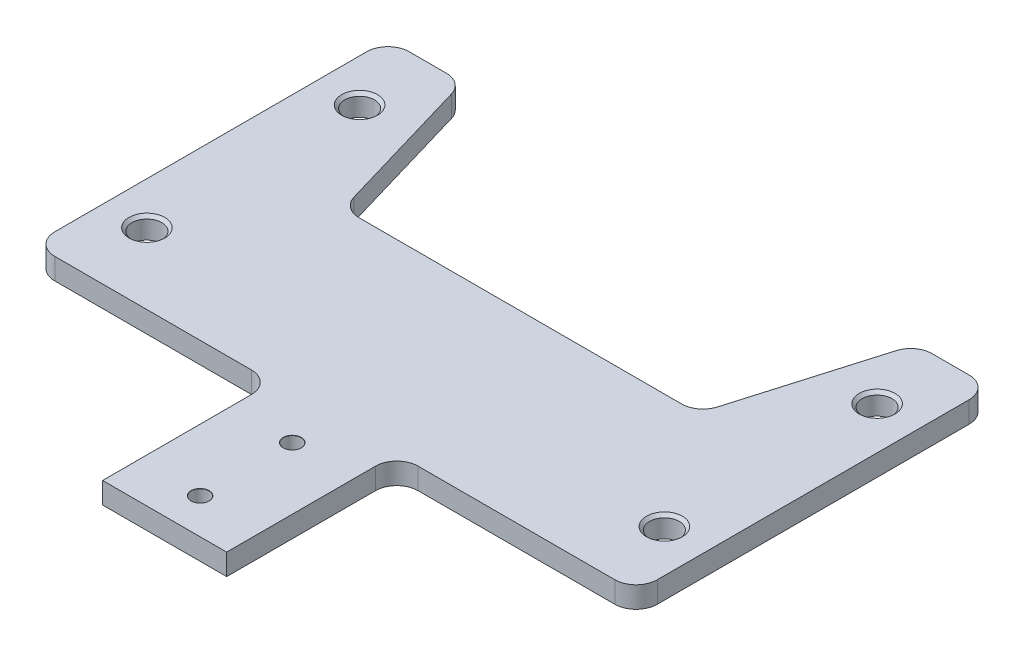
ISO-10303-21;
HEADER;
FILE_DESCRIPTION(('STEP AP214'),'2;1');
FILE_NAME('part.step','',(''),(''),'','','');
FILE_SCHEMA(('AUTOMOTIVE_DESIGN { 1 0 10303 214 1 1 1 1 }'));
ENDSEC;
DATA;
#1=APPLICATION_CONTEXT('core data for automotive mechanical design processes');
#2=APPLICATION_PROTOCOL_DEFINITION('international standard','automotive_design',2000,#1);
#3=PRODUCT_CONTEXT('',#1,'mechanical');
#4=PRODUCT('Part','Part','',(#3));
#5=PRODUCT_RELATED_PRODUCT_CATEGORY('part','',(#4));
#6=PRODUCT_DEFINITION_FORMATION('','',#4);
#7=PRODUCT_DEFINITION_CONTEXT('part definition',#1,'design');
#8=PRODUCT_DEFINITION('design','',#6,#7);
#9=PRODUCT_DEFINITION_SHAPE('','',#8);
#10=(LENGTH_UNIT() NAMED_UNIT(*) SI_UNIT(.MILLI.,.METRE.));
#11=(NAMED_UNIT(*) PLANE_ANGLE_UNIT() SI_UNIT($,.RADIAN.));
#12=(NAMED_UNIT(*) SI_UNIT($,.STERADIAN.) SOLID_ANGLE_UNIT());
#13=UNCERTAINTY_MEASURE_WITH_UNIT(LENGTH_MEASURE(1.E-05),#10,'distance_accuracy_value','');
#14=(GEOMETRIC_REPRESENTATION_CONTEXT(3) GLOBAL_UNCERTAINTY_ASSIGNED_CONTEXT((#13)) GLOBAL_UNIT_ASSIGNED_CONTEXT((#10,
#11,#12)) REPRESENTATION_CONTEXT('',''));
#15=CARTESIAN_POINT('',(0.,0.,0.));
#16=DIRECTION('',(0.,0.,1.));
#17=DIRECTION('',(1.,0.,0.));
#18=AXIS2_PLACEMENT_3D('',#15,#16,#17);
#19=CARTESIAN_POINT('',(-42.5,3.,0.));
#20=DIRECTION('',(0.,0.,-1.));
#21=DIRECTION('',(-1.,0.,0.));
#22=AXIS2_PLACEMENT_3D('',#19,#20,#21);
#23=PLANE('',#22);
#24=DIRECTION('',(1.,0.,0.));
#25=VECTOR('',#24,1.);
#26=CARTESIAN_POINT('',(-42.5,3.,0.));
#27=LINE('',#26,#25);
#28=CARTESIAN_POINT('',(11.75,3.,0.));
#29=VERTEX_POINT('',#28);
#30=CARTESIAN_POINT('',(39.5,3.,0.));
#31=VERTEX_POINT('',#30);
#32=EDGE_CURVE('E226',#29,#31,#27,.T.);
#33=ORIENTED_EDGE('',*,*,#32,.F.);
#34=DIRECTION('',(0.,1.,0.));
#35=VECTOR('',#34,1.);
#36=CARTESIAN_POINT('',(11.75,3.,0.));
#37=LINE('',#36,#35);
#38=CARTESIAN_POINT('',(11.75,0.,0.));
#39=VERTEX_POINT('',#38);
#40=EDGE_CURVE('E290',#29,#39,#37,.F.);
#41=ORIENTED_EDGE('',*,*,#40,.T.);
#42=DIRECTION('',(1.,0.,0.));
#43=VECTOR('',#42,1.);
#44=CARTESIAN_POINT('',(-42.5,0.,0.));
#45=LINE('',#44,#43);
#46=CARTESIAN_POINT('',(39.5,0.,0.));
#47=VERTEX_POINT('',#46);
#48=EDGE_CURVE('E221',#39,#47,#45,.T.);
#49=ORIENTED_EDGE('',*,*,#48,.T.);
#50=DIRECTION('',(0.,-1.,0.));
#51=VECTOR('',#50,1.);
#52=CARTESIAN_POINT('',(39.5,3.,0.));
#53=LINE('',#52,#51);
#54=EDGE_CURVE('E288',#47,#31,#53,.F.);
#55=ORIENTED_EDGE('',*,*,#54,.T.);
#56=EDGE_LOOP('',(#33,#41,#49,#55));
#57=FACE_BOUND('',#56,.T.);
#58=ADVANCED_FACE('F37',(#57),#23,.F.);
#59=CARTESIAN_POINT('',(-39.5,0.,0.));
#60=VERTEX_POINT('',#59);
#61=CARTESIAN_POINT('',(-11.75,0.,0.));
#62=VERTEX_POINT('',#61);
#63=EDGE_CURVE('E241',#60,#62,#45,.T.);
#64=ORIENTED_EDGE('',*,*,#63,.T.);
#65=DIRECTION('',(0.,1.,0.));
#66=VECTOR('',#65,1.);
#67=CARTESIAN_POINT('',(-11.75,3.,0.));
#68=LINE('',#67,#66);
#69=CARTESIAN_POINT('',(-11.75,3.,0.));
#70=VERTEX_POINT('',#69);
#71=EDGE_CURVE('E295',#62,#70,#68,.T.);
#72=ORIENTED_EDGE('',*,*,#71,.T.);
#73=CARTESIAN_POINT('',(-39.5,3.,0.));
#74=VERTEX_POINT('',#73);
#75=EDGE_CURVE('E223',#74,#70,#27,.T.);
#76=ORIENTED_EDGE('',*,*,#75,.F.);
#77=DIRECTION('',(0.,-1.,0.));
#78=VECTOR('',#77,1.);
#79=CARTESIAN_POINT('',(-39.5,3.,0.));
#80=LINE('',#79,#78);
#81=EDGE_CURVE('E292',#74,#60,#80,.T.);
#82=ORIENTED_EDGE('',*,*,#81,.T.);
#83=EDGE_LOOP('',(#64,#72,#76,#82));
#84=FACE_BOUND('',#83,.T.);
#85=ADVANCED_FACE('F447',(#84),#23,.F.);
#86=CARTESIAN_POINT('',(42.5,3.,0.));
#87=DIRECTION('',(-1.,0.,0.));
#88=DIRECTION('',(0.,0.,1.));
#89=AXIS2_PLACEMENT_3D('',#86,#87,#88);
#90=PLANE('',#89);
#91=DIRECTION('',(0.,0.,-1.));
#92=VECTOR('',#91,1.);
#93=CARTESIAN_POINT('',(42.5,3.,0.));
#94=LINE('',#93,#92);
#95=CARTESIAN_POINT('',(42.5,3.,-3.00000000000002));
#96=VERTEX_POINT('',#95);
#97=CARTESIAN_POINT('',(42.5,3.,-47.));
#98=VERTEX_POINT('',#97);
#99=EDGE_CURVE('E225',#96,#98,#94,.T.);
#100=ORIENTED_EDGE('',*,*,#99,.F.);
#101=DIRECTION('',(0.,-1.,0.));
#102=VECTOR('',#101,1.);
#103=CARTESIAN_POINT('',(42.5,3.,-3.00000000000002));
#104=LINE('',#103,#102);
#105=CARTESIAN_POINT('',(42.5,0.,-3.00000000000002));
#106=VERTEX_POINT('',#105);
#107=EDGE_CURVE('E302',#96,#106,#104,.T.);
#108=ORIENTED_EDGE('',*,*,#107,.T.);
#109=DIRECTION('',(0.,0.,-1.));
#110=VECTOR('',#109,1.);
#111=CARTESIAN_POINT('',(42.5,0.,0.));
#112=LINE('',#111,#110);
#113=CARTESIAN_POINT('',(42.5,0.,-47.));
#114=VERTEX_POINT('',#113);
#115=EDGE_CURVE('E244',#106,#114,#112,.T.);
#116=ORIENTED_EDGE('',*,*,#115,.T.);
#117=DIRECTION('',(0.,-1.,0.));
#118=VECTOR('',#117,1.);
#119=CARTESIAN_POINT('',(42.5,3.,-47.));
#120=LINE('',#119,#118);
#121=EDGE_CURVE('E300',#114,#98,#120,.F.);
#122=ORIENTED_EDGE('',*,*,#121,.T.);
#123=EDGE_LOOP('',(#100,#108,#116,#122));
#124=FACE_BOUND('',#123,.T.);
#125=ADVANCED_FACE('F451',(#124),#90,.F.);
#126=CARTESIAN_POINT('',(42.5,3.,-50.));
#127=DIRECTION('',(0.,0.,1.));
#128=DIRECTION('',(1.,0.,0.));
#129=AXIS2_PLACEMENT_3D('',#126,#127,#128);
#130=PLANE('',#129);
#131=DIRECTION('',(-1.,0.,0.));
#132=VECTOR('',#131,1.);
#133=CARTESIAN_POINT('',(42.5,3.,-50.));
#134=LINE('',#133,#132);
#135=CARTESIAN_POINT('',(39.5,3.,-50.));
#136=VERTEX_POINT('',#135);
#137=CARTESIAN_POINT('',(34.2451314063093,3.,-50.));
#138=VERTEX_POINT('',#137);
#139=EDGE_CURVE('E229',#136,#138,#134,.T.);
#140=ORIENTED_EDGE('',*,*,#139,.F.);
#141=DIRECTION('',(0.,-1.,0.));
#142=VECTOR('',#141,1.);
#143=CARTESIAN_POINT('',(39.5,3.,-50.));
#144=LINE('',#143,#142);
#145=CARTESIAN_POINT('',(39.5,0.,-50.));
#146=VERTEX_POINT('',#145);
#147=EDGE_CURVE('E336',#136,#146,#144,.T.);
#148=ORIENTED_EDGE('',*,*,#147,.T.);
#149=DIRECTION('',(-1.,0.,0.));
#150=VECTOR('',#149,1.);
#151=CARTESIAN_POINT('',(42.5,0.,-50.));
#152=LINE('',#151,#150);
#153=CARTESIAN_POINT('',(34.2451314063093,0.,-50.));
#154=VERTEX_POINT('',#153);
#155=EDGE_CURVE('E247',#146,#154,#152,.T.);
#156=ORIENTED_EDGE('',*,*,#155,.T.);
#157=DIRECTION('',(0.,-1.,0.));
#158=VECTOR('',#157,1.);
#159=CARTESIAN_POINT('',(34.2451314063093,3.,-50.));
#160=LINE('',#159,#158);
#161=EDGE_CURVE('E334',#154,#138,#160,.F.);
#162=ORIENTED_EDGE('',*,*,#161,.T.);
#163=EDGE_LOOP('',(#140,#148,#156,#162));
#164=FACE_BOUND('',#163,.T.);
#165=ADVANCED_FACE('F456',(#164),#130,.F.);
#166=CARTESIAN_POINT('',(8.75,3.,-26.1843013959278));
#167=DIRECTION('',(0.,0.,1.));
#168=DIRECTION('',(1.,0.,0.));
#169=AXIS2_PLACEMENT_3D('',#166,#167,#168);
#170=PLANE('',#169);
#171=DIRECTION('',(-1.,0.,0.));
#172=VECTOR('',#171,1.);
#173=CARTESIAN_POINT('',(8.75,3.,-26.1843013959278));
#174=LINE('',#173,#172);
#175=CARTESIAN_POINT('',(22.7548685936907,3.,-26.1843013959278));
#176=VERTEX_POINT('',#175);
#177=CARTESIAN_POINT('',(-22.7548685936907,3.,-26.1843013959278));
#178=VERTEX_POINT('',#177);
#179=EDGE_CURVE('E232',#176,#178,#174,.T.);
#180=ORIENTED_EDGE('',*,*,#179,.F.);
#181=DIRECTION('',(0.,-1.,0.));
#182=VECTOR('',#181,1.);
#183=CARTESIAN_POINT('',(22.7548685936907,0.,-26.1843013959278));
#184=LINE('',#183,#182);
#185=CARTESIAN_POINT('',(22.7548685936907,0.,-26.1843013959278));
#186=VERTEX_POINT('',#185);
#187=EDGE_CURVE('E355',#176,#186,#184,.T.);
#188=ORIENTED_EDGE('',*,*,#187,.T.);
#189=DIRECTION('',(-1.,0.,0.));
#190=VECTOR('',#189,1.);
#191=CARTESIAN_POINT('',(8.75,0.,-26.1843013959278));
#192=LINE('',#191,#190);
#193=CARTESIAN_POINT('',(-22.7548685936907,0.,-26.1843013959278));
#194=VERTEX_POINT('',#193);
#195=EDGE_CURVE('E250',#186,#194,#192,.T.);
#196=ORIENTED_EDGE('',*,*,#195,.T.);
#197=DIRECTION('',(0.,-1.,0.));
#198=VECTOR('',#197,1.);
#199=CARTESIAN_POINT('',(-22.7548685936907,3.,-26.1843013959278));
#200=LINE('',#199,#198);
#201=EDGE_CURVE('E52',#194,#178,#200,.F.);
#202=ORIENTED_EDGE('',*,*,#201,.T.);
#203=EDGE_LOOP('',(#180,#188,#196,#202));
#204=FACE_BOUND('',#203,.T.);
#205=ADVANCED_FACE('F376',(#204),#170,.F.);
#206=CARTESIAN_POINT('',(-22.5,3.,-50.));
#207=DIRECTION('',(0.,0.,1.));
#208=DIRECTION('',(1.,0.,0.));
#209=AXIS2_PLACEMENT_3D('',#206,#207,#208);
#210=PLANE('',#209);
#211=DIRECTION('',(-1.,0.,0.));
#212=VECTOR('',#211,1.);
#213=CARTESIAN_POINT('',(-22.5,0.,-50.));
#214=LINE('',#213,#212);
#215=CARTESIAN_POINT('',(-34.2451314063093,0.,-50.));
#216=VERTEX_POINT('',#215);
#217=CARTESIAN_POINT('',(-39.5,0.,-50.));
#218=VERTEX_POINT('',#217);
#219=EDGE_CURVE('E252',#216,#218,#214,.T.);
#220=ORIENTED_EDGE('',*,*,#219,.T.);
#221=DIRECTION('',(0.,-1.,0.));
#222=VECTOR('',#221,1.);
#223=CARTESIAN_POINT('',(-39.5,3.,-50.));
#224=LINE('',#223,#222);
#225=CARTESIAN_POINT('',(-39.5,3.,-50.));
#226=VERTEX_POINT('',#225);
#227=EDGE_CURVE('E342',#218,#226,#224,.F.);
#228=ORIENTED_EDGE('',*,*,#227,.T.);
#229=DIRECTION('',(-1.,0.,0.));
#230=VECTOR('',#229,1.);
#231=CARTESIAN_POINT('',(-22.5,3.,-50.));
#232=LINE('',#231,#230);
#233=CARTESIAN_POINT('',(-34.2451314063093,3.,-50.));
#234=VERTEX_POINT('',#233);
#235=EDGE_CURVE('E234',#234,#226,#232,.T.);
#236=ORIENTED_EDGE('',*,*,#235,.F.);
#237=DIRECTION('',(0.,-1.,0.));
#238=VECTOR('',#237,1.);
#239=CARTESIAN_POINT('',(-34.2451314063093,3.,-50.));
#240=LINE('',#239,#238);
#241=EDGE_CURVE('E339',#234,#216,#240,.T.);
#242=ORIENTED_EDGE('',*,*,#241,.T.);
#243=EDGE_LOOP('',(#220,#228,#236,#242));
#244=FACE_BOUND('',#243,.T.);
#245=ADVANCED_FACE('F463',(#244),#210,.F.);
#246=CARTESIAN_POINT('',(-42.5,3.,-50.));
#247=DIRECTION('',(1.,0.,0.));
#248=DIRECTION('',(0.,0.,-1.));
#249=AXIS2_PLACEMENT_3D('',#246,#247,#248);
#250=PLANE('',#249);
#251=DIRECTION('',(0.,0.,1.));
#252=VECTOR('',#251,1.);
#253=CARTESIAN_POINT('',(-42.5,0.,-50.));
#254=LINE('',#253,#252);
#255=CARTESIAN_POINT('',(-42.5,0.,-47.));
#256=VERTEX_POINT('',#255);
#257=CARTESIAN_POINT('',(-42.5,0.,-3.));
#258=VERTEX_POINT('',#257);
#259=EDGE_CURVE('E255',#256,#258,#254,.T.);
#260=ORIENTED_EDGE('',*,*,#259,.T.);
#261=DIRECTION('',(0.,-1.,0.));
#262=VECTOR('',#261,1.);
#263=CARTESIAN_POINT('',(-42.5,3.,-3.));
#264=LINE('',#263,#262);
#265=CARTESIAN_POINT('',(-42.5,3.,-3.));
#266=VERTEX_POINT('',#265);
#267=EDGE_CURVE('E332',#258,#266,#264,.F.);
#268=ORIENTED_EDGE('',*,*,#267,.T.);
#269=DIRECTION('',(0.,0.,1.));
#270=VECTOR('',#269,1.);
#271=CARTESIAN_POINT('',(-42.5,3.,-50.));
#272=LINE('',#271,#270);
#273=CARTESIAN_POINT('',(-42.5,3.,-47.));
#274=VERTEX_POINT('',#273);
#275=EDGE_CURVE('E237',#274,#266,#272,.T.);
#276=ORIENTED_EDGE('',*,*,#275,.F.);
#277=DIRECTION('',(0.,-1.,0.));
#278=VECTOR('',#277,1.);
#279=CARTESIAN_POINT('',(-42.5,3.,-47.));
#280=LINE('',#279,#278);
#281=EDGE_CURVE('E329',#274,#256,#280,.T.);
#282=ORIENTED_EDGE('',*,*,#281,.T.);
#283=EDGE_LOOP('',(#260,#268,#276,#282));
#284=FACE_BOUND('',#283,.T.);
#285=ADVANCED_FACE('F466',(#284),#250,.F.);
#286=CARTESIAN_POINT('',(0.,3.,0.));
#287=DIRECTION('',(0.,1.,0.));
#288=DIRECTION('',(0.,0.,1.));
#289=AXIS2_PLACEMENT_3D('',#286,#287,#288);
#290=PLANE('',#289);
#291=ORIENTED_EDGE('',*,*,#32,.T.);
#292=CARTESIAN_POINT('',(39.5,3.,-3.00000000000002));
#293=DIRECTION('',(0.,1.,0.));
#294=DIRECTION('',(0.,0.,1.));
#295=AXIS2_PLACEMENT_3D('',#292,#293,#294);
#296=CIRCLE('',#295,3.);
#297=EDGE_CURVE('E327',#31,#96,#296,.T.);
#298=ORIENTED_EDGE('',*,*,#297,.T.);
#299=ORIENTED_EDGE('',*,*,#99,.T.);
#300=CARTESIAN_POINT('',(39.5,3.,-47.));
#301=DIRECTION('',(0.,1.,0.));
#302=DIRECTION('',(0.,0.,1.));
#303=AXIS2_PLACEMENT_3D('',#300,#301,#302);
#304=CIRCLE('',#303,3.);
#305=EDGE_CURVE('E323',#98,#136,#304,.T.);
#306=ORIENTED_EDGE('',*,*,#305,.T.);
#307=ORIENTED_EDGE('',*,*,#139,.T.);
#308=CARTESIAN_POINT('',(34.2451314063093,3.,-47.));
#309=DIRECTION('',(0.,1.,0.));
#310=DIRECTION('',(0.,0.,1.));
#311=AXIS2_PLACEMENT_3D('',#308,#309,#310);
#312=CIRCLE('',#311,3.);
#313=CARTESIAN_POINT('',(31.3668838920355,3.,-47.8459853701907));
#314=VERTEX_POINT('',#313);
#315=EDGE_CURVE('E317',#138,#314,#312,.T.);
#316=ORIENTED_EDGE('',*,*,#315,.T.);
#317=DIRECTION('',(-0.281995123396906,0.,0.959415838091265));
#318=VECTOR('',#317,1.);
#319=CARTESIAN_POINT('',(25.,3.,-26.1843013959278));
#320=LINE('',#319,#318);
#321=CARTESIAN_POINT('',(25.6331161079645,3.,-28.3383160257371));
#322=VERTEX_POINT('',#321);
#323=EDGE_CURVE('E387',#314,#322,#320,.T.);
#324=ORIENTED_EDGE('',*,*,#323,.T.);
#325=CARTESIAN_POINT('',(22.7548685936907,3.,-29.1843013959278));
#326=DIRECTION('',(0.,1.,0.));
#327=DIRECTION('',(0.,0.,1.));
#328=AXIS2_PLACEMENT_3D('',#325,#326,#327);
#329=CIRCLE('',#328,3.);
#330=EDGE_CURVE('E59',#322,#176,#329,.F.);
#331=ORIENTED_EDGE('',*,*,#330,.T.);
#332=ORIENTED_EDGE('',*,*,#179,.T.);
#333=CARTESIAN_POINT('',(-22.7548685936907,3.,-29.1843013959278));
#334=DIRECTION('',(0.,1.,0.));
#335=DIRECTION('',(0.,0.,1.));
#336=AXIS2_PLACEMENT_3D('',#333,#334,#335);
#337=CIRCLE('',#336,3.);
#338=CARTESIAN_POINT('',(-25.6331161079645,3.,-28.3383160257371));
#339=VERTEX_POINT('',#338);
#340=EDGE_CURVE('E11',#178,#339,#337,.F.);
#341=ORIENTED_EDGE('',*,*,#340,.T.);
#342=DIRECTION('',(-0.281995123396906,0.,-0.959415838091265));
#343=VECTOR('',#342,1.);
#344=CARTESIAN_POINT('',(-32.,3.,-50.));
#345=LINE('',#344,#343);
#346=CARTESIAN_POINT('',(-31.3668838920355,3.,-47.8459853701907));
#347=VERTEX_POINT('',#346);
#348=EDGE_CURVE('E381',#339,#347,#345,.T.);
#349=ORIENTED_EDGE('',*,*,#348,.T.);
#350=CARTESIAN_POINT('',(-34.2451314063093,3.,-47.));
#351=DIRECTION('',(0.,1.,0.));
#352=DIRECTION('',(0.,0.,1.));
#353=AXIS2_PLACEMENT_3D('',#350,#351,#352);
#354=CIRCLE('',#353,3.);
#355=EDGE_CURVE('E319',#347,#234,#354,.T.);
#356=ORIENTED_EDGE('',*,*,#355,.T.);
#357=ORIENTED_EDGE('',*,*,#235,.T.);
#358=CARTESIAN_POINT('',(-39.5,3.,-47.));
#359=DIRECTION('',(0.,1.,0.));
#360=DIRECTION('',(0.,0.,1.));
#361=AXIS2_PLACEMENT_3D('',#358,#359,#360);
#362=CIRCLE('',#361,3.);
#363=EDGE_CURVE('E321',#226,#274,#362,.T.);
#364=ORIENTED_EDGE('',*,*,#363,.T.);
#365=ORIENTED_EDGE('',*,*,#275,.T.);
#366=CARTESIAN_POINT('',(-39.5,3.,-3.));
#367=DIRECTION('',(0.,1.,0.));
#368=DIRECTION('',(0.,0.,1.));
#369=AXIS2_PLACEMENT_3D('',#366,#367,#368);
#370=CIRCLE('',#369,3.);
#371=EDGE_CURVE('E325',#266,#74,#370,.T.);
#372=ORIENTED_EDGE('',*,*,#371,.T.);
#373=ORIENTED_EDGE('',*,*,#75,.T.);
#374=CARTESIAN_POINT('',(-11.75,3.,2.99999999999999));
#375=DIRECTION('',(0.,1.,0.));
#376=DIRECTION('',(0.,0.,1.));
#377=AXIS2_PLACEMENT_3D('',#374,#375,#376);
#378=CIRCLE('',#377,3.);
#379=CARTESIAN_POINT('',(-8.75,3.,2.99999999999999));
#380=VERTEX_POINT('',#379);
#381=EDGE_CURVE('E196',#70,#380,#378,.F.);
#382=ORIENTED_EDGE('',*,*,#381,.T.);
#383=DIRECTION('',(0.,0.,1.));
#384=VECTOR('',#383,1.);
#385=CARTESIAN_POINT('',(-8.75,3.,0.));
#386=LINE('',#385,#384);
#387=CARTESIAN_POINT('',(-8.75,3.,24.));
#388=VERTEX_POINT('',#387);
#389=EDGE_CURVE('E186',#380,#388,#386,.T.);
#390=ORIENTED_EDGE('',*,*,#389,.T.);
#391=DIRECTION('',(1.,0.,0.));
#392=VECTOR('',#391,1.);
#393=CARTESIAN_POINT('',(-8.75,3.,24.));
#394=LINE('',#393,#392);
#395=CARTESIAN_POINT('',(8.75,3.,24.));
#396=VERTEX_POINT('',#395);
#397=EDGE_CURVE('E193',#388,#396,#394,.T.);
#398=ORIENTED_EDGE('',*,*,#397,.T.);
#399=DIRECTION('',(0.,0.,-1.));
#400=VECTOR('',#399,1.);
#401=CARTESIAN_POINT('',(8.75,3.,24.));
#402=LINE('',#401,#400);
#403=CARTESIAN_POINT('',(8.75,3.,2.99999999999999));
#404=VERTEX_POINT('',#403);
#405=EDGE_CURVE('E210',#396,#404,#402,.T.);
#406=ORIENTED_EDGE('',*,*,#405,.T.);
#407=CARTESIAN_POINT('',(11.75,3.,2.99999999999999));
#408=DIRECTION('',(0.,1.,0.));
#409=DIRECTION('',(0.,0.,1.));
#410=AXIS2_PLACEMENT_3D('',#407,#408,#409);
#411=CIRCLE('',#410,3.);
#412=EDGE_CURVE('E358',#404,#29,#411,.F.);
#413=ORIENTED_EDGE('',*,*,#412,.T.);
#414=EDGE_LOOP('',(#291,#298,#299,#306,#307,#316,#324,#331,#332,#341,#349,#356,#357,#364,#365,
#372,#373,#382,#390,#398,#406,#413));
#415=FACE_BOUND('',#414,.T.);
#416=CARTESIAN_POINT('',(-36.5,3.,-40.));
#417=DIRECTION('',(0.,1.,0.));
#418=DIRECTION('',(0.,0.,1.));
#419=AXIS2_PLACEMENT_3D('',#416,#417,#418);
#420=CIRCLE('',#419,2.525);
#421=CARTESIAN_POINT('',(-36.5,3.,-37.475));
#422=VERTEX_POINT('',#421);
#423=EDGE_CURVE('E386',#422,#422,#420,.T.);
#424=ORIENTED_EDGE('',*,*,#423,.F.);
#425=EDGE_LOOP('',(#424));
#426=FACE_BOUND('',#425,.T.);
#427=CARTESIAN_POINT('',(36.5,3.,-40.));
#428=DIRECTION('',(0.,1.,0.));
#429=DIRECTION('',(0.,0.,1.));
#430=AXIS2_PLACEMENT_3D('',#427,#428,#429);
#431=CIRCLE('',#430,2.525);
#432=CARTESIAN_POINT('',(36.5,3.,-37.475));
#433=VERTEX_POINT('',#432);
#434=EDGE_CURVE('E284',#433,#433,#431,.T.);
#435=ORIENTED_EDGE('',*,*,#434,.F.);
#436=EDGE_LOOP('',(#435));
#437=FACE_BOUND('',#436,.T.);
#438=CARTESIAN_POINT('',(-36.5,3.,-10.));
#439=DIRECTION('',(0.,1.,0.));
#440=DIRECTION('',(0.,0.,1.));
#441=AXIS2_PLACEMENT_3D('',#438,#439,#440);
#442=CIRCLE('',#441,2.525);
#443=CARTESIAN_POINT('',(-36.5,3.,-7.475));
#444=VERTEX_POINT('',#443);
#445=EDGE_CURVE('E279',#444,#444,#442,.T.);
#446=ORIENTED_EDGE('',*,*,#445,.F.);
#447=EDGE_LOOP('',(#446));
#448=FACE_BOUND('',#447,.T.);
#449=CARTESIAN_POINT('',(36.5,3.,-10.));
#450=DIRECTION('',(0.,1.,0.));
#451=DIRECTION('',(0.,0.,1.));
#452=AXIS2_PLACEMENT_3D('',#449,#450,#451);
#453=CIRCLE('',#452,2.525);
#454=CARTESIAN_POINT('',(36.5,3.,-7.475));
#455=VERTEX_POINT('',#454);
#456=EDGE_CURVE('E274',#455,#455,#453,.T.);
#457=ORIENTED_EDGE('',*,*,#456,.F.);
#458=EDGE_LOOP('',(#457));
#459=FACE_BOUND('',#458,.T.);
#460=CARTESIAN_POINT('',(0.,3.,19.));
#461=DIRECTION('',(0.,1.,0.));
#462=DIRECTION('',(0.,0.,1.));
#463=AXIS2_PLACEMENT_3D('',#460,#461,#462);
#464=CIRCLE('',#463,1.275);
#465=CARTESIAN_POINT('',(0.,3.,20.275));
#466=VERTEX_POINT('',#465);
#467=EDGE_CURVE('E269',#466,#466,#464,.T.);
#468=ORIENTED_EDGE('',*,*,#467,.F.);
#469=EDGE_LOOP('',(#468));
#470=FACE_BOUND('',#469,.T.);
#471=CARTESIAN_POINT('',(0.,3.,6.));
#472=DIRECTION('',(0.,1.,0.));
#473=DIRECTION('',(0.,0.,1.));
#474=AXIS2_PLACEMENT_3D('',#471,#472,#473);
#475=CIRCLE('',#474,1.275);
#476=CARTESIAN_POINT('',(0.,3.,7.275));
#477=VERTEX_POINT('',#476);
#478=EDGE_CURVE('E264',#477,#477,#475,.T.);
#479=ORIENTED_EDGE('',*,*,#478,.F.);
#480=EDGE_LOOP('',(#479));
#481=FACE_BOUND('',#480,.T.);
#482=ADVANCED_FACE('F189',(#415,#426,#437,#448,#459,#470,#481),#290,.T.);
#483=CARTESIAN_POINT('',(0.,0.,0.));
#484=DIRECTION('',(0.,1.,0.));
#485=DIRECTION('',(0.,0.,1.));
#486=AXIS2_PLACEMENT_3D('',#483,#484,#485);
#487=PLANE('',#486);
#488=CARTESIAN_POINT('',(-36.5,0.,-40.));
#489=DIRECTION('',(0.,1.,0.));
#490=DIRECTION('',(0.,0.,1.));
#491=AXIS2_PLACEMENT_3D('',#488,#489,#490);
#492=CIRCLE('',#491,2.1);
#493=CARTESIAN_POINT('',(-36.5,0.,-37.9));
#494=VERTEX_POINT('',#493);
#495=EDGE_CURVE('E281',#494,#494,#492,.T.);
#496=ORIENTED_EDGE('',*,*,#495,.T.);
#497=EDGE_LOOP('',(#496));
#498=FACE_BOUND('',#497,.T.);
#499=CARTESIAN_POINT('',(36.5,0.,-40.));
#500=DIRECTION('',(0.,1.,0.));
#501=DIRECTION('',(0.,0.,1.));
#502=AXIS2_PLACEMENT_3D('',#499,#500,#501);
#503=CIRCLE('',#502,2.1);
#504=CARTESIAN_POINT('',(36.5,0.,-37.9));
#505=VERTEX_POINT('',#504);
#506=EDGE_CURVE('E276',#505,#505,#503,.T.);
#507=ORIENTED_EDGE('',*,*,#506,.T.);
#508=EDGE_LOOP('',(#507));
#509=FACE_BOUND('',#508,.T.);
#510=CARTESIAN_POINT('',(-36.5,0.,-10.));
#511=DIRECTION('',(0.,1.,0.));
#512=DIRECTION('',(0.,0.,1.));
#513=AXIS2_PLACEMENT_3D('',#510,#511,#512);
#514=CIRCLE('',#513,2.1);
#515=CARTESIAN_POINT('',(-36.5,0.,-7.9));
#516=VERTEX_POINT('',#515);
#517=EDGE_CURVE('E271',#516,#516,#514,.T.);
#518=ORIENTED_EDGE('',*,*,#517,.T.);
#519=EDGE_LOOP('',(#518));
#520=FACE_BOUND('',#519,.T.);
#521=CARTESIAN_POINT('',(36.5,0.,-10.));
#522=DIRECTION('',(0.,1.,0.));
#523=DIRECTION('',(0.,0.,1.));
#524=AXIS2_PLACEMENT_3D('',#521,#522,#523);
#525=CIRCLE('',#524,2.1);
#526=CARTESIAN_POINT('',(36.5,0.,-7.9));
#527=VERTEX_POINT('',#526);
#528=EDGE_CURVE('E266',#527,#527,#525,.T.);
#529=ORIENTED_EDGE('',*,*,#528,.T.);
#530=EDGE_LOOP('',(#529));
#531=FACE_BOUND('',#530,.T.);
#532=CARTESIAN_POINT('',(0.,0.,19.));
#533=DIRECTION('',(0.,1.,0.));
#534=DIRECTION('',(0.,0.,1.));
#535=AXIS2_PLACEMENT_3D('',#532,#533,#534);
#536=CIRCLE('',#535,1.25);
#537=CARTESIAN_POINT('',(0.,0.,20.25));
#538=VERTEX_POINT('',#537);
#539=EDGE_CURVE('E261',#538,#538,#536,.T.);
#540=ORIENTED_EDGE('',*,*,#539,.T.);
#541=EDGE_LOOP('',(#540));
#542=FACE_BOUND('',#541,.T.);
#543=CARTESIAN_POINT('',(0.,0.,6.));
#544=DIRECTION('',(0.,1.,0.));
#545=DIRECTION('',(0.,0.,1.));
#546=AXIS2_PLACEMENT_3D('',#543,#544,#545);
#547=CIRCLE('',#546,1.25);
#548=CARTESIAN_POINT('',(0.,0.,7.25));
#549=VERTEX_POINT('',#548);
#550=EDGE_CURVE('E199',#549,#549,#547,.T.);
#551=ORIENTED_EDGE('',*,*,#550,.T.);
#552=EDGE_LOOP('',(#551));
#553=FACE_BOUND('',#552,.T.);
#554=ORIENTED_EDGE('',*,*,#115,.F.);
#555=CARTESIAN_POINT('',(39.5,0.,-3.00000000000002));
#556=DIRECTION('',(0.,1.,0.));
#557=DIRECTION('',(0.,0.,1.));
#558=AXIS2_PLACEMENT_3D('',#555,#556,#557);
#559=CIRCLE('',#558,3.);
#560=EDGE_CURVE('E315',#106,#47,#559,.F.);
#561=ORIENTED_EDGE('',*,*,#560,.T.);
#562=ORIENTED_EDGE('',*,*,#48,.F.);
#563=CARTESIAN_POINT('',(11.75,0.,2.99999999999999));
#564=DIRECTION('',(0.,1.,0.));
#565=DIRECTION('',(0.,0.,1.));
#566=AXIS2_PLACEMENT_3D('',#563,#564,#565);
#567=CIRCLE('',#566,3.);
#568=CARTESIAN_POINT('',(8.75,0.,2.99999999999999));
#569=VERTEX_POINT('',#568);
#570=EDGE_CURVE('E360',#39,#569,#567,.T.);
#571=ORIENTED_EDGE('',*,*,#570,.T.);
#572=DIRECTION('',(0.,0.,1.));
#573=VECTOR('',#572,1.);
#574=CARTESIAN_POINT('',(8.75,0.,24.));
#575=LINE('',#574,#573);
#576=CARTESIAN_POINT('',(8.75,0.,24.));
#577=VERTEX_POINT('',#576);
#578=EDGE_CURVE('E222',#569,#577,#575,.T.);
#579=ORIENTED_EDGE('',*,*,#578,.T.);
#580=DIRECTION('',(-1.,0.,0.));
#581=VECTOR('',#580,1.);
#582=CARTESIAN_POINT('',(-8.75,0.,24.));
#583=LINE('',#582,#581);
#584=CARTESIAN_POINT('',(-8.75,0.,24.));
#585=VERTEX_POINT('',#584);
#586=EDGE_CURVE('E218',#577,#585,#583,.T.);
#587=ORIENTED_EDGE('',*,*,#586,.T.);
#588=DIRECTION('',(0.,0.,-1.));
#589=VECTOR('',#588,1.);
#590=CARTESIAN_POINT('',(-8.75,0.,0.));
#591=LINE('',#590,#589);
#592=CARTESIAN_POINT('',(-8.75,0.,2.99999999999999));
#593=VERTEX_POINT('',#592);
#594=EDGE_CURVE('E206',#585,#593,#591,.T.);
#595=ORIENTED_EDGE('',*,*,#594,.T.);
#596=CARTESIAN_POINT('',(-11.75,0.,2.99999999999999));
#597=DIRECTION('',(0.,1.,0.));
#598=DIRECTION('',(0.,0.,1.));
#599=AXIS2_PLACEMENT_3D('',#596,#597,#598);
#600=CIRCLE('',#599,3.);
#601=EDGE_CURVE('E363',#593,#62,#600,.T.);
#602=ORIENTED_EDGE('',*,*,#601,.T.);
#603=ORIENTED_EDGE('',*,*,#63,.F.);
#604=CARTESIAN_POINT('',(-39.5,0.,-3.));
#605=DIRECTION('',(0.,1.,0.));
#606=DIRECTION('',(0.,0.,1.));
#607=AXIS2_PLACEMENT_3D('',#604,#605,#606);
#608=CIRCLE('',#607,3.);
#609=EDGE_CURVE('E313',#60,#258,#608,.F.);
#610=ORIENTED_EDGE('',*,*,#609,.T.);
#611=ORIENTED_EDGE('',*,*,#259,.F.);
#612=CARTESIAN_POINT('',(-39.5,0.,-47.));
#613=DIRECTION('',(0.,1.,0.));
#614=DIRECTION('',(0.,0.,1.));
#615=AXIS2_PLACEMENT_3D('',#612,#613,#614);
#616=CIRCLE('',#615,3.);
#617=EDGE_CURVE('E309',#256,#218,#616,.F.);
#618=ORIENTED_EDGE('',*,*,#617,.T.);
#619=ORIENTED_EDGE('',*,*,#219,.F.);
#620=CARTESIAN_POINT('',(-34.2451314063093,0.,-47.));
#621=DIRECTION('',(0.,1.,0.));
#622=DIRECTION('',(0.,0.,1.));
#623=AXIS2_PLACEMENT_3D('',#620,#621,#622);
#624=CIRCLE('',#623,3.);
#625=CARTESIAN_POINT('',(-31.3668838920355,0.,-47.8459853701907));
#626=VERTEX_POINT('',#625);
#627=EDGE_CURVE('E307',#216,#626,#624,.F.);
#628=ORIENTED_EDGE('',*,*,#627,.T.);
#629=DIRECTION('',(-0.281995123396906,0.,-0.959415838091265));
#630=VECTOR('',#629,1.);
#631=CARTESIAN_POINT('',(-32.,0.,-50.));
#632=LINE('',#631,#630);
#633=CARTESIAN_POINT('',(-25.6331161079645,0.,-28.3383160257371));
#634=VERTEX_POINT('',#633);
#635=EDGE_CURVE('E373',#634,#626,#632,.T.);
#636=ORIENTED_EDGE('',*,*,#635,.F.);
#637=CARTESIAN_POINT('',(-22.7548685936907,0.,-29.1843013959278));
#638=DIRECTION('',(0.,1.,0.));
#639=DIRECTION('',(0.,0.,1.));
#640=AXIS2_PLACEMENT_3D('',#637,#638,#639);
#641=CIRCLE('',#640,3.);
#642=EDGE_CURVE('E45',#634,#194,#641,.T.);
#643=ORIENTED_EDGE('',*,*,#642,.T.);
#644=ORIENTED_EDGE('',*,*,#195,.F.);
#645=CARTESIAN_POINT('',(22.7548685936907,0.,-29.1843013959278));
#646=DIRECTION('',(0.,1.,0.));
#647=DIRECTION('',(0.,0.,1.));
#648=AXIS2_PLACEMENT_3D('',#645,#646,#647);
#649=CIRCLE('',#648,3.);
#650=CARTESIAN_POINT('',(25.6331161079645,0.,-28.3383160257371));
#651=VERTEX_POINT('',#650);
#652=EDGE_CURVE('E365',#186,#651,#649,.T.);
#653=ORIENTED_EDGE('',*,*,#652,.T.);
#654=DIRECTION('',(-0.281995123396906,0.,0.959415838091265));
#655=VECTOR('',#654,1.);
#656=CARTESIAN_POINT('',(25.,0.,-26.1843013959278));
#657=LINE('',#656,#655);
#658=CARTESIAN_POINT('',(31.3668838920355,0.,-47.8459853701907));
#659=VERTEX_POINT('',#658);
#660=EDGE_CURVE('E393',#659,#651,#657,.T.);
#661=ORIENTED_EDGE('',*,*,#660,.F.);
#662=CARTESIAN_POINT('',(34.2451314063093,0.,-47.));
#663=DIRECTION('',(0.,1.,0.));
#664=DIRECTION('',(0.,0.,1.));
#665=AXIS2_PLACEMENT_3D('',#662,#663,#664);
#666=CIRCLE('',#665,3.);
#667=EDGE_CURVE('E305',#659,#154,#666,.F.);
#668=ORIENTED_EDGE('',*,*,#667,.T.);
#669=ORIENTED_EDGE('',*,*,#155,.F.);
#670=CARTESIAN_POINT('',(39.5,0.,-47.));
#671=DIRECTION('',(0.,1.,0.));
#672=DIRECTION('',(0.,0.,1.));
#673=AXIS2_PLACEMENT_3D('',#670,#671,#672);
#674=CIRCLE('',#673,3.);
#675=EDGE_CURVE('E311',#146,#114,#674,.F.);
#676=ORIENTED_EDGE('',*,*,#675,.T.);
#677=EDGE_LOOP('',(#554,#561,#562,#571,#579,#587,#595,#602,#603,#610,#611,#618,#619,#628,#636,
#643,#644,#653,#661,#668,#669,#676));
#678=FACE_BOUND('',#677,.T.);
#679=ADVANCED_FACE('F371',(#498,#509,#520,#531,#542,#553,#678),#487,.F.);
#680=CARTESIAN_POINT('',(8.75,-29.7026934805583,24.));
#681=DIRECTION('',(1.,0.,0.));
#682=DIRECTION('',(0.,0.,-1.));
#683=AXIS2_PLACEMENT_3D('',#680,#681,#682);
#684=PLANE('',#683);
#685=ORIENTED_EDGE('',*,*,#578,.F.);
#686=DIRECTION('',(0.,1.,0.));
#687=VECTOR('',#686,1.);
#688=CARTESIAN_POINT('',(8.75,-29.7026934805583,2.99999999999999));
#689=LINE('',#688,#687);
#690=EDGE_CURVE('E240',#569,#404,#689,.T.);
#691=ORIENTED_EDGE('',*,*,#690,.T.);
#692=ORIENTED_EDGE('',*,*,#405,.F.);
#693=DIRECTION('',(0.,1.,0.));
#694=VECTOR('',#693,1.);
#695=CARTESIAN_POINT('',(8.75,-29.7026934805583,24.));
#696=LINE('',#695,#694);
#697=EDGE_CURVE('E209',#577,#396,#696,.T.);
#698=ORIENTED_EDGE('',*,*,#697,.F.);
#699=EDGE_LOOP('',(#685,#691,#692,#698));
#700=FACE_BOUND('',#699,.T.);
#701=ADVANCED_FACE('F424',(#700),#684,.T.);
#702=CARTESIAN_POINT('',(-8.75,-29.7026934805583,24.));
#703=DIRECTION('',(0.,0.,1.));
#704=DIRECTION('',(1.,0.,0.));
#705=AXIS2_PLACEMENT_3D('',#702,#703,#704);
#706=PLANE('',#705);
#707=ORIENTED_EDGE('',*,*,#586,.F.);
#708=ORIENTED_EDGE('',*,*,#697,.T.);
#709=ORIENTED_EDGE('',*,*,#397,.F.);
#710=DIRECTION('',(0.,1.,0.));
#711=VECTOR('',#710,1.);
#712=CARTESIAN_POINT('',(-8.75,-29.7026934805583,24.));
#713=LINE('',#712,#711);
#714=EDGE_CURVE('E203',#585,#388,#713,.T.);
#715=ORIENTED_EDGE('',*,*,#714,.F.);
#716=EDGE_LOOP('',(#707,#708,#709,#715));
#717=FACE_BOUND('',#716,.T.);
#718=ADVANCED_FACE('F212',(#717),#706,.T.);
#719=CARTESIAN_POINT('',(-8.75,-29.7026934805583,0.));
#720=DIRECTION('',(-1.,0.,0.));
#721=DIRECTION('',(0.,0.,1.));
#722=AXIS2_PLACEMENT_3D('',#719,#720,#721);
#723=PLANE('',#722);
#724=ORIENTED_EDGE('',*,*,#389,.F.);
#725=DIRECTION('',(0.,1.,0.));
#726=VECTOR('',#725,1.);
#727=CARTESIAN_POINT('',(-8.75,-29.7026934805583,2.99999999999999));
#728=LINE('',#727,#726);
#729=EDGE_CURVE('E298',#380,#593,#728,.F.);
#730=ORIENTED_EDGE('',*,*,#729,.T.);
#731=ORIENTED_EDGE('',*,*,#594,.F.);
#732=ORIENTED_EDGE('',*,*,#714,.T.);
#733=EDGE_LOOP('',(#724,#730,#731,#732));
#734=FACE_BOUND('',#733,.T.);
#735=ADVANCED_FACE('F204',(#734),#723,.T.);
#736=CARTESIAN_POINT('',(0.,3.,6.));
#737=DIRECTION('',(0.,1.,0.));
#738=DIRECTION('',(0.,0.,1.));
#739=AXIS2_PLACEMENT_3D('',#736,#737,#738);
#740=CYLINDRICAL_SURFACE('',#739,1.25);
#741=CARTESIAN_POINT('',(0.,2.975,6.));
#742=DIRECTION('',(0.,1.,0.));
#743=DIRECTION('',(0.,0.,1.));
#744=AXIS2_PLACEMENT_3D('',#741,#742,#743);
#745=CIRCLE('',#744,1.25);
#746=CARTESIAN_POINT('',(0.,2.975,7.25));
#747=VERTEX_POINT('',#746);
#748=EDGE_CURVE('E260',#747,#747,#745,.T.);
#749=ORIENTED_EDGE('',*,*,#748,.T.);
#750=EDGE_LOOP('',(#749));
#751=FACE_BOUND('',#750,.T.);
#752=ORIENTED_EDGE('',*,*,#550,.F.);
#753=EDGE_LOOP('',(#752));
#754=FACE_BOUND('',#753,.T.);
#755=ADVANCED_FACE('F478',(#751,#754),#740,.F.);
#756=CARTESIAN_POINT('',(0.,3.,6.));
#757=DIRECTION('',(0.,1.,0.));
#758=DIRECTION('',(0.,0.,1.));
#759=AXIS2_PLACEMENT_3D('',#756,#757,#758);
#760=CONICAL_SURFACE('',#759,1.275,0.785398163397431);
#761=ORIENTED_EDGE('',*,*,#748,.F.);
#762=EDGE_LOOP('',(#761));
#763=FACE_BOUND('',#762,.T.);
#764=ORIENTED_EDGE('',*,*,#478,.T.);
#765=EDGE_LOOP('',(#764));
#766=FACE_BOUND('',#765,.T.);
#767=ADVANCED_FACE('F485',(#763,#766),#760,.F.);
#768=CARTESIAN_POINT('',(0.,3.,19.));
#769=DIRECTION('',(0.,1.,0.));
#770=DIRECTION('',(0.,0.,1.));
#771=AXIS2_PLACEMENT_3D('',#768,#769,#770);
#772=CYLINDRICAL_SURFACE('',#771,1.25);
#773=CARTESIAN_POINT('',(0.,2.975,19.));
#774=DIRECTION('',(0.,1.,0.));
#775=DIRECTION('',(0.,0.,1.));
#776=AXIS2_PLACEMENT_3D('',#773,#774,#775);
#777=CIRCLE('',#776,1.25);
#778=CARTESIAN_POINT('',(0.,2.975,20.25));
#779=VERTEX_POINT('',#778);
#780=EDGE_CURVE('E265',#779,#779,#777,.T.);
#781=ORIENTED_EDGE('',*,*,#780,.T.);
#782=EDGE_LOOP('',(#781));
#783=FACE_BOUND('',#782,.T.);
#784=ORIENTED_EDGE('',*,*,#539,.F.);
#785=EDGE_LOOP('',(#784));
#786=FACE_BOUND('',#785,.T.);
#787=ADVANCED_FACE('F489',(#783,#786),#772,.F.);
#788=CARTESIAN_POINT('',(0.,3.,19.));
#789=DIRECTION('',(0.,1.,0.));
#790=DIRECTION('',(0.,0.,1.));
#791=AXIS2_PLACEMENT_3D('',#788,#789,#790);
#792=CONICAL_SURFACE('',#791,1.275,0.785398163397431);
#793=ORIENTED_EDGE('',*,*,#780,.F.);
#794=EDGE_LOOP('',(#793));
#795=FACE_BOUND('',#794,.T.);
#796=ORIENTED_EDGE('',*,*,#467,.T.);
#797=EDGE_LOOP('',(#796));
#798=FACE_BOUND('',#797,.T.);
#799=ADVANCED_FACE('F493',(#795,#798),#792,.F.);
#800=CARTESIAN_POINT('',(36.5,3.,-10.));
#801=DIRECTION('',(0.,1.,0.));
#802=DIRECTION('',(0.,0.,1.));
#803=AXIS2_PLACEMENT_3D('',#800,#801,#802);
#804=CYLINDRICAL_SURFACE('',#803,2.1);
#805=CARTESIAN_POINT('',(36.5,2.575,-10.));
#806=DIRECTION('',(0.,1.,0.));
#807=DIRECTION('',(0.,0.,1.));
#808=AXIS2_PLACEMENT_3D('',#805,#806,#807);
#809=CIRCLE('',#808,2.1);
#810=CARTESIAN_POINT('',(36.5,2.575,-7.9));
#811=VERTEX_POINT('',#810);
#812=EDGE_CURVE('E270',#811,#811,#809,.T.);
#813=ORIENTED_EDGE('',*,*,#812,.T.);
#814=EDGE_LOOP('',(#813));
#815=FACE_BOUND('',#814,.T.);
#816=ORIENTED_EDGE('',*,*,#528,.F.);
#817=EDGE_LOOP('',(#816));
#818=FACE_BOUND('',#817,.T.);
#819=ADVANCED_FACE('F497',(#815,#818),#804,.F.);
#820=CARTESIAN_POINT('',(36.5,3.,-10.));
#821=DIRECTION('',(0.,1.,0.));
#822=DIRECTION('',(0.,0.,1.));
#823=AXIS2_PLACEMENT_3D('',#820,#821,#822);
#824=CONICAL_SURFACE('',#823,2.525,0.785398163397448);
#825=ORIENTED_EDGE('',*,*,#812,.F.);
#826=EDGE_LOOP('',(#825));
#827=FACE_BOUND('',#826,.T.);
#828=ORIENTED_EDGE('',*,*,#456,.T.);
#829=EDGE_LOOP('',(#828));
#830=FACE_BOUND('',#829,.T.);
#831=ADVANCED_FACE('F501',(#827,#830),#824,.F.);
#832=CARTESIAN_POINT('',(-36.5,3.,-10.));
#833=DIRECTION('',(0.,1.,0.));
#834=DIRECTION('',(0.,0.,1.));
#835=AXIS2_PLACEMENT_3D('',#832,#833,#834);
#836=CYLINDRICAL_SURFACE('',#835,2.1);
#837=CARTESIAN_POINT('',(-36.5,2.575,-10.));
#838=DIRECTION('',(0.,1.,0.));
#839=DIRECTION('',(0.,0.,1.));
#840=AXIS2_PLACEMENT_3D('',#837,#838,#839);
#841=CIRCLE('',#840,2.1);
#842=CARTESIAN_POINT('',(-36.5,2.575,-7.9));
#843=VERTEX_POINT('',#842);
#844=EDGE_CURVE('E275',#843,#843,#841,.T.);
#845=ORIENTED_EDGE('',*,*,#844,.T.);
#846=EDGE_LOOP('',(#845));
#847=FACE_BOUND('',#846,.T.);
#848=ORIENTED_EDGE('',*,*,#517,.F.);
#849=EDGE_LOOP('',(#848));
#850=FACE_BOUND('',#849,.T.);
#851=ADVANCED_FACE('F505',(#847,#850),#836,.F.);
#852=CARTESIAN_POINT('',(-36.5,3.,-10.));
#853=DIRECTION('',(0.,1.,0.));
#854=DIRECTION('',(0.,0.,1.));
#855=AXIS2_PLACEMENT_3D('',#852,#853,#854);
#856=CONICAL_SURFACE('',#855,2.525,0.785398163397448);
#857=ORIENTED_EDGE('',*,*,#844,.F.);
#858=EDGE_LOOP('',(#857));
#859=FACE_BOUND('',#858,.T.);
#860=ORIENTED_EDGE('',*,*,#445,.T.);
#861=EDGE_LOOP('',(#860));
#862=FACE_BOUND('',#861,.T.);
#863=ADVANCED_FACE('F509',(#859,#862),#856,.F.);
#864=CARTESIAN_POINT('',(36.5,3.,-40.));
#865=DIRECTION('',(0.,1.,0.));
#866=DIRECTION('',(0.,0.,1.));
#867=AXIS2_PLACEMENT_3D('',#864,#865,#866);
#868=CYLINDRICAL_SURFACE('',#867,2.1);
#869=CARTESIAN_POINT('',(36.5,2.575,-40.));
#870=DIRECTION('',(0.,1.,0.));
#871=DIRECTION('',(0.,0.,1.));
#872=AXIS2_PLACEMENT_3D('',#869,#870,#871);
#873=CIRCLE('',#872,2.1);
#874=CARTESIAN_POINT('',(36.5,2.575,-37.9));
#875=VERTEX_POINT('',#874);
#876=EDGE_CURVE('E280',#875,#875,#873,.T.);
#877=ORIENTED_EDGE('',*,*,#876,.T.);
#878=EDGE_LOOP('',(#877));
#879=FACE_BOUND('',#878,.T.);
#880=ORIENTED_EDGE('',*,*,#506,.F.);
#881=EDGE_LOOP('',(#880));
#882=FACE_BOUND('',#881,.T.);
#883=ADVANCED_FACE('F513',(#879,#882),#868,.F.);
#884=CARTESIAN_POINT('',(36.5,3.,-40.));
#885=DIRECTION('',(0.,1.,0.));
#886=DIRECTION('',(0.,0.,1.));
#887=AXIS2_PLACEMENT_3D('',#884,#885,#886);
#888=CONICAL_SURFACE('',#887,2.525,0.785398163397448);
#889=ORIENTED_EDGE('',*,*,#876,.F.);
#890=EDGE_LOOP('',(#889));
#891=FACE_BOUND('',#890,.T.);
#892=ORIENTED_EDGE('',*,*,#434,.T.);
#893=EDGE_LOOP('',(#892));
#894=FACE_BOUND('',#893,.T.);
#895=ADVANCED_FACE('F517',(#891,#894),#888,.F.);
#896=CARTESIAN_POINT('',(-36.5,3.,-40.));
#897=DIRECTION('',(0.,1.,0.));
#898=DIRECTION('',(0.,0.,1.));
#899=AXIS2_PLACEMENT_3D('',#896,#897,#898);
#900=CYLINDRICAL_SURFACE('',#899,2.1);
#901=CARTESIAN_POINT('',(-36.5,2.575,-40.));
#902=DIRECTION('',(0.,1.,0.));
#903=DIRECTION('',(0.,0.,1.));
#904=AXIS2_PLACEMENT_3D('',#901,#902,#903);
#905=CIRCLE('',#904,2.1);
#906=CARTESIAN_POINT('',(-36.5,2.575,-37.9));
#907=VERTEX_POINT('',#906);
#908=EDGE_CURVE('E285',#907,#907,#905,.T.);
#909=ORIENTED_EDGE('',*,*,#908,.T.);
#910=EDGE_LOOP('',(#909));
#911=FACE_BOUND('',#910,.T.);
#912=ORIENTED_EDGE('',*,*,#495,.F.);
#913=EDGE_LOOP('',(#912));
#914=FACE_BOUND('',#913,.T.);
#915=ADVANCED_FACE('F521',(#911,#914),#900,.F.);
#916=CARTESIAN_POINT('',(-36.5,3.,-40.));
#917=DIRECTION('',(0.,1.,0.));
#918=DIRECTION('',(0.,0.,1.));
#919=AXIS2_PLACEMENT_3D('',#916,#917,#918);
#920=CONICAL_SURFACE('',#919,2.525,0.785398163397448);
#921=ORIENTED_EDGE('',*,*,#908,.F.);
#922=EDGE_LOOP('',(#921));
#923=FACE_BOUND('',#922,.T.);
#924=ORIENTED_EDGE('',*,*,#423,.T.);
#925=EDGE_LOOP('',(#924));
#926=FACE_BOUND('',#925,.T.);
#927=ADVANCED_FACE('F525',(#923,#926),#920,.F.);
#928=CARTESIAN_POINT('',(25.,3.,-26.1843013959278));
#929=DIRECTION('',(0.959415838091265,0.,0.281995123396906));
#930=DIRECTION('',(0.281995123396906,0.,-0.959415838091265));
#931=AXIS2_PLACEMENT_3D('',#928,#929,#930);
#932=PLANE('',#931);
#933=ORIENTED_EDGE('',*,*,#323,.F.);
#934=DIRECTION('',(0.,-1.,0.));
#935=VECTOR('',#934,1.);
#936=CARTESIAN_POINT('',(31.3668838920355,3.,-47.8459853701907));
#937=LINE('',#936,#935);
#938=EDGE_CURVE('E351',#314,#659,#937,.T.);
#939=ORIENTED_EDGE('',*,*,#938,.T.);
#940=ORIENTED_EDGE('',*,*,#660,.T.);
#941=DIRECTION('',(0.,-1.,0.));
#942=VECTOR('',#941,1.);
#943=CARTESIAN_POINT('',(25.6331161079645,3.,-28.3383160257371));
#944=LINE('',#943,#942);
#945=EDGE_CURVE('E349',#651,#322,#944,.F.);
#946=ORIENTED_EDGE('',*,*,#945,.T.);
#947=EDGE_LOOP('',(#933,#939,#940,#946));
#948=FACE_BOUND('',#947,.T.);
#949=ADVANCED_FACE('F443',(#948),#932,.F.);
#950=CARTESIAN_POINT('',(-32.,3.,-50.));
#951=DIRECTION('',(-0.959415838091265,0.,0.281995123396906));
#952=DIRECTION('',(0.281995123396906,0.,0.959415838091265));
#953=AXIS2_PLACEMENT_3D('',#950,#951,#952);
#954=PLANE('',#953);
#955=ORIENTED_EDGE('',*,*,#635,.T.);
#956=DIRECTION('',(0.,-1.,0.));
#957=VECTOR('',#956,1.);
#958=CARTESIAN_POINT('',(-31.3668838920355,3.,-47.8459853701907));
#959=LINE('',#958,#957);
#960=EDGE_CURVE('E347',#626,#347,#959,.F.);
#961=ORIENTED_EDGE('',*,*,#960,.T.);
#962=ORIENTED_EDGE('',*,*,#348,.F.);
#963=DIRECTION('',(0.,-1.,0.));
#964=VECTOR('',#963,1.);
#965=CARTESIAN_POINT('',(-25.6331161079645,0.,-28.3383160257371));
#966=LINE('',#965,#964);
#967=EDGE_CURVE('E344',#339,#634,#966,.T.);
#968=ORIENTED_EDGE('',*,*,#967,.T.);
#969=EDGE_LOOP('',(#955,#961,#962,#968));
#970=FACE_BOUND('',#969,.T.);
#971=ADVANCED_FACE('F384',(#970),#954,.F.);
#972=CARTESIAN_POINT('',(11.75,-29.7026934805583,2.99999999999999));
#973=DIRECTION('',(0.,1.,0.));
#974=DIRECTION('',(0.,0.,1.));
#975=AXIS2_PLACEMENT_3D('',#972,#973,#974);
#976=CYLINDRICAL_SURFACE('',#975,3.);
#977=ORIENTED_EDGE('',*,*,#570,.F.);
#978=ORIENTED_EDGE('',*,*,#40,.F.);
#979=ORIENTED_EDGE('',*,*,#412,.F.);
#980=ORIENTED_EDGE('',*,*,#690,.F.);
#981=EDGE_LOOP('',(#977,#978,#979,#980));
#982=FACE_BOUND('',#981,.T.);
#983=ADVANCED_FACE('F432',(#982),#976,.F.);
#984=CARTESIAN_POINT('',(-11.75,3.,2.99999999999999));
#985=DIRECTION('',(0.,1.,0.));
#986=DIRECTION('',(0.,0.,1.));
#987=AXIS2_PLACEMENT_3D('',#984,#985,#986);
#988=CYLINDRICAL_SURFACE('',#987,3.);
#989=ORIENTED_EDGE('',*,*,#601,.F.);
#990=ORIENTED_EDGE('',*,*,#729,.F.);
#991=ORIENTED_EDGE('',*,*,#381,.F.);
#992=ORIENTED_EDGE('',*,*,#71,.F.);
#993=EDGE_LOOP('',(#989,#990,#991,#992));
#994=FACE_BOUND('',#993,.T.);
#995=ADVANCED_FACE('F434',(#994),#988,.F.);
#996=CARTESIAN_POINT('',(39.5,3.,-3.00000000000002));
#997=DIRECTION('',(0.,-1.,0.));
#998=DIRECTION('',(0.,0.,-1.));
#999=AXIS2_PLACEMENT_3D('',#996,#997,#998);
#1000=CYLINDRICAL_SURFACE('',#999,3.);
#1001=ORIENTED_EDGE('',*,*,#297,.F.);
#1002=ORIENTED_EDGE('',*,*,#54,.F.);
#1003=ORIENTED_EDGE('',*,*,#560,.F.);
#1004=ORIENTED_EDGE('',*,*,#107,.F.);
#1005=EDGE_LOOP('',(#1001,#1002,#1003,#1004));
#1006=FACE_BOUND('',#1005,.T.);
#1007=ADVANCED_FACE('F440',(#1006),#1000,.T.);
#1008=CARTESIAN_POINT('',(-39.5,3.,-3.));
#1009=DIRECTION('',(0.,-1.,0.));
#1010=DIRECTION('',(0.,0.,-1.));
#1011=AXIS2_PLACEMENT_3D('',#1008,#1009,#1010);
#1012=CYLINDRICAL_SURFACE('',#1011,3.);
#1013=ORIENTED_EDGE('',*,*,#371,.F.);
#1014=ORIENTED_EDGE('',*,*,#267,.F.);
#1015=ORIENTED_EDGE('',*,*,#609,.F.);
#1016=ORIENTED_EDGE('',*,*,#81,.F.);
#1017=EDGE_LOOP('',(#1013,#1014,#1015,#1016));
#1018=FACE_BOUND('',#1017,.T.);
#1019=ADVANCED_FACE('F553',(#1018),#1012,.T.);
#1020=CARTESIAN_POINT('',(39.5,3.,-47.));
#1021=DIRECTION('',(0.,-1.,0.));
#1022=DIRECTION('',(0.,0.,-1.));
#1023=AXIS2_PLACEMENT_3D('',#1020,#1021,#1022);
#1024=CYLINDRICAL_SURFACE('',#1023,3.);
#1025=ORIENTED_EDGE('',*,*,#305,.F.);
#1026=ORIENTED_EDGE('',*,*,#121,.F.);
#1027=ORIENTED_EDGE('',*,*,#675,.F.);
#1028=ORIENTED_EDGE('',*,*,#147,.F.);
#1029=EDGE_LOOP('',(#1025,#1026,#1027,#1028));
#1030=FACE_BOUND('',#1029,.T.);
#1031=ADVANCED_FACE('F547',(#1030),#1024,.T.);
#1032=CARTESIAN_POINT('',(-39.5,3.,-47.));
#1033=DIRECTION('',(0.,-1.,0.));
#1034=DIRECTION('',(0.,0.,-1.));
#1035=AXIS2_PLACEMENT_3D('',#1032,#1033,#1034);
#1036=CYLINDRICAL_SURFACE('',#1035,3.);
#1037=ORIENTED_EDGE('',*,*,#363,.F.);
#1038=ORIENTED_EDGE('',*,*,#227,.F.);
#1039=ORIENTED_EDGE('',*,*,#617,.F.);
#1040=ORIENTED_EDGE('',*,*,#281,.F.);
#1041=EDGE_LOOP('',(#1037,#1038,#1039,#1040));
#1042=FACE_BOUND('',#1041,.T.);
#1043=ADVANCED_FACE('F563',(#1042),#1036,.T.);
#1044=CARTESIAN_POINT('',(-34.2451314063093,3.,-47.));
#1045=DIRECTION('',(0.,-1.,0.));
#1046=DIRECTION('',(0.,0.,-1.));
#1047=AXIS2_PLACEMENT_3D('',#1044,#1045,#1046);
#1048=CYLINDRICAL_SURFACE('',#1047,3.);
#1049=ORIENTED_EDGE('',*,*,#355,.F.);
#1050=ORIENTED_EDGE('',*,*,#960,.F.);
#1051=ORIENTED_EDGE('',*,*,#627,.F.);
#1052=ORIENTED_EDGE('',*,*,#241,.F.);
#1053=EDGE_LOOP('',(#1049,#1050,#1051,#1052));
#1054=FACE_BOUND('',#1053,.T.);
#1055=ADVANCED_FACE('F566',(#1054),#1048,.T.);
#1056=CARTESIAN_POINT('',(34.2451314063093,3.,-47.));
#1057=DIRECTION('',(0.,-1.,0.));
#1058=DIRECTION('',(0.,0.,-1.));
#1059=AXIS2_PLACEMENT_3D('',#1056,#1057,#1058);
#1060=CYLINDRICAL_SURFACE('',#1059,3.);
#1061=ORIENTED_EDGE('',*,*,#315,.F.);
#1062=ORIENTED_EDGE('',*,*,#161,.F.);
#1063=ORIENTED_EDGE('',*,*,#667,.F.);
#1064=ORIENTED_EDGE('',*,*,#938,.F.);
#1065=EDGE_LOOP('',(#1061,#1062,#1063,#1064));
#1066=FACE_BOUND('',#1065,.T.);
#1067=ADVANCED_FACE('F540',(#1066),#1060,.T.);
#1068=CARTESIAN_POINT('',(22.7548685936907,3.,-29.1843013959278));
#1069=DIRECTION('',(0.,1.,0.));
#1070=DIRECTION('',(0.,0.,1.));
#1071=AXIS2_PLACEMENT_3D('',#1068,#1069,#1070);
#1072=CYLINDRICAL_SURFACE('',#1071,3.);
#1073=ORIENTED_EDGE('',*,*,#330,.F.);
#1074=ORIENTED_EDGE('',*,*,#945,.F.);
#1075=ORIENTED_EDGE('',*,*,#652,.F.);
#1076=ORIENTED_EDGE('',*,*,#187,.F.);
#1077=EDGE_LOOP('',(#1073,#1074,#1075,#1076));
#1078=FACE_BOUND('',#1077,.T.);
#1079=ADVANCED_FACE('F572',(#1078),#1072,.F.);
#1080=CARTESIAN_POINT('',(-22.7548685936907,3.,-29.1843013959278));
#1081=DIRECTION('',(0.,1.,0.));
#1082=DIRECTION('',(0.,0.,1.));
#1083=AXIS2_PLACEMENT_3D('',#1080,#1081,#1082);
#1084=CYLINDRICAL_SURFACE('',#1083,3.);
#1085=ORIENTED_EDGE('',*,*,#340,.F.);
#1086=ORIENTED_EDGE('',*,*,#201,.F.);
#1087=ORIENTED_EDGE('',*,*,#642,.F.);
#1088=ORIENTED_EDGE('',*,*,#967,.F.);
#1089=EDGE_LOOP('',(#1085,#1086,#1087,#1088));
#1090=FACE_BOUND('',#1089,.T.);
#1091=ADVANCED_FACE('F39',(#1090),#1084,.F.);
#1092=CLOSED_SHELL('',(#58,#85,#125,#165,#205,#245,#285,#482,#679,#701,#718,#735,#755,#767,#787,
#799,#819,#831,#851,#863,#883,#895,#915,#927,#949,#971,#983,#995,#1007,#1019,#1031,#1043,#1055,
#1067,#1079,#1091));
#1093=MANIFOLD_SOLID_BREP('B2',#1092);
#1094=ADVANCED_BREP_SHAPE_REPRESENTATION('',(#18,#1093),#14);
#1095=SHAPE_DEFINITION_REPRESENTATION(#9,#1094);
ENDSEC;
END-ISO-10303-21;
